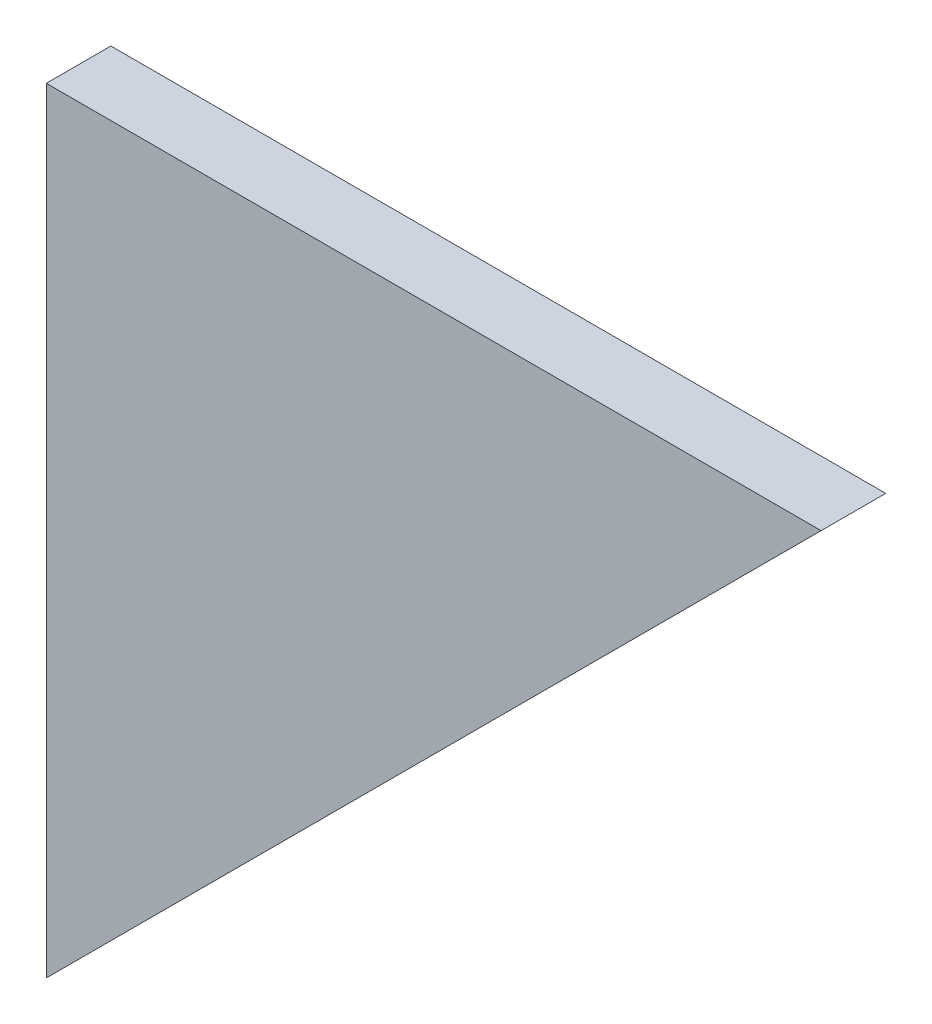
ISO-10303-21;
HEADER;
FILE_DESCRIPTION(('STEP AP214'),'2;1');
FILE_NAME('part.step','',(''),(''),'','','');
FILE_SCHEMA(('AUTOMOTIVE_DESIGN { 1 0 10303 214 1 1 1 1 }'));
ENDSEC;
DATA;
#1=APPLICATION_CONTEXT('core data for automotive mechanical design processes');
#2=APPLICATION_PROTOCOL_DEFINITION('international standard','automotive_design',2000,#1);
#3=PRODUCT_CONTEXT('',#1,'mechanical');
#4=PRODUCT('Part','Part','',(#3));
#5=PRODUCT_RELATED_PRODUCT_CATEGORY('part','',(#4));
#6=PRODUCT_DEFINITION_FORMATION('','',#4);
#7=PRODUCT_DEFINITION_CONTEXT('part definition',#1,'design');
#8=PRODUCT_DEFINITION('design','',#6,#7);
#9=PRODUCT_DEFINITION_SHAPE('','',#8);
#10=(LENGTH_UNIT() NAMED_UNIT(*) SI_UNIT(.MILLI.,.METRE.));
#11=(NAMED_UNIT(*) PLANE_ANGLE_UNIT() SI_UNIT($,.RADIAN.));
#12=(NAMED_UNIT(*) SI_UNIT($,.STERADIAN.) SOLID_ANGLE_UNIT());
#13=UNCERTAINTY_MEASURE_WITH_UNIT(LENGTH_MEASURE(1.E-05),#10,'distance_accuracy_value','');
#14=(GEOMETRIC_REPRESENTATION_CONTEXT(3) GLOBAL_UNCERTAINTY_ASSIGNED_CONTEXT((#13)) GLOBAL_UNIT_ASSIGNED_CONTEXT((#10,
#11,#12)) REPRESENTATION_CONTEXT('',''));
#15=CARTESIAN_POINT('',(0.,0.,0.));
#16=DIRECTION('',(0.,0.,1.));
#17=DIRECTION('',(1.,0.,0.));
#18=AXIS2_PLACEMENT_3D('',#15,#16,#17);
#19=CARTESIAN_POINT('',(0.,-76.2,3.175));
#20=DIRECTION('',(1.,0.,0.));
#21=DIRECTION('',(0.,0.,-1.));
#22=AXIS2_PLACEMENT_3D('',#19,#20,#21);
#23=PLANE('',#22);
#24=DIRECTION('',(0.,-1.,0.));
#25=VECTOR('',#24,1.);
#26=CARTESIAN_POINT('',(0.,-76.2,-3.175));
#27=LINE('',#26,#25);
#28=CARTESIAN_POINT('',(0.,0.,-3.175));
#29=VERTEX_POINT('',#28);
#30=CARTESIAN_POINT('',(0.,-76.2,-3.175));
#31=VERTEX_POINT('',#30);
#32=EDGE_CURVE('E80',#29,#31,#27,.T.);
#33=ORIENTED_EDGE('',*,*,#32,.T.);
#34=DIRECTION('',(0.,0.,-1.));
#35=VECTOR('',#34,1.);
#36=CARTESIAN_POINT('',(0.,-76.2,3.175));
#37=LINE('',#36,#35);
#38=CARTESIAN_POINT('',(0.,-76.2,3.175));
#39=VERTEX_POINT('',#38);
#40=EDGE_CURVE('E11',#39,#31,#37,.T.);
#41=ORIENTED_EDGE('',*,*,#40,.F.);
#42=DIRECTION('',(0.,-1.,0.));
#43=VECTOR('',#42,1.);
#44=CARTESIAN_POINT('',(0.,-76.2,3.175));
#45=LINE('',#44,#43);
#46=CARTESIAN_POINT('',(0.,0.,3.175));
#47=VERTEX_POINT('',#46);
#48=EDGE_CURVE('E73',#47,#39,#45,.T.);
#49=ORIENTED_EDGE('',*,*,#48,.F.);
#50=DIRECTION('',(0.,0.,-1.));
#51=VECTOR('',#50,1.);
#52=CARTESIAN_POINT('',(0.,0.,3.175));
#53=LINE('',#52,#51);
#54=EDGE_CURVE('E81',#47,#29,#53,.T.);
#55=ORIENTED_EDGE('',*,*,#54,.T.);
#56=EDGE_LOOP('',(#33,#41,#49,#55));
#57=FACE_BOUND('',#56,.T.);
#58=ADVANCED_FACE('F33',(#57),#23,.F.);
#59=CARTESIAN_POINT('',(76.2,0.,3.175));
#60=DIRECTION('',(-0.707106781186548,0.707106781186548,0.));
#61=DIRECTION('',(-0.707106781186548,-0.707106781186548,0.));
#62=AXIS2_PLACEMENT_3D('',#59,#60,#61);
#63=PLANE('',#62);
#64=DIRECTION('',(0.707106781186547,0.707106781186547,0.));
#65=VECTOR('',#64,1.);
#66=CARTESIAN_POINT('',(76.2,0.,-3.175));
#67=LINE('',#66,#65);
#68=CARTESIAN_POINT('',(76.2,0.,-3.175));
#69=VERTEX_POINT('',#68);
#70=EDGE_CURVE('E61',#31,#69,#67,.T.);
#71=ORIENTED_EDGE('',*,*,#70,.T.);
#72=DIRECTION('',(0.,0.,-1.));
#73=VECTOR('',#72,1.);
#74=CARTESIAN_POINT('',(76.2,0.,3.175));
#75=LINE('',#74,#73);
#76=CARTESIAN_POINT('',(76.2,0.,3.175));
#77=VERTEX_POINT('',#76);
#78=EDGE_CURVE('E41',#77,#69,#75,.T.);
#79=ORIENTED_EDGE('',*,*,#78,.F.);
#80=DIRECTION('',(0.707106781186547,0.707106781186547,0.));
#81=VECTOR('',#80,1.);
#82=CARTESIAN_POINT('',(76.2,0.,3.175));
#83=LINE('',#82,#81);
#84=EDGE_CURVE('E69',#39,#77,#83,.T.);
#85=ORIENTED_EDGE('',*,*,#84,.F.);
#86=ORIENTED_EDGE('',*,*,#40,.T.);
#87=EDGE_LOOP('',(#71,#79,#85,#86));
#88=FACE_BOUND('',#87,.T.);
#89=ADVANCED_FACE('F70',(#88),#63,.F.);
#90=CARTESIAN_POINT('',(0.,0.,3.175));
#91=DIRECTION('',(0.,-1.,0.));
#92=DIRECTION('',(0.,0.,-1.));
#93=AXIS2_PLACEMENT_3D('',#90,#91,#92);
#94=PLANE('',#93);
#95=DIRECTION('',(-1.,0.,0.));
#96=VECTOR('',#95,1.);
#97=CARTESIAN_POINT('',(0.,0.,-3.175));
#98=LINE('',#97,#96);
#99=EDGE_CURVE('E66',#69,#29,#98,.T.);
#100=ORIENTED_EDGE('',*,*,#99,.T.);
#101=ORIENTED_EDGE('',*,*,#54,.F.);
#102=DIRECTION('',(-1.,0.,0.));
#103=VECTOR('',#102,1.);
#104=CARTESIAN_POINT('',(0.,0.,3.175));
#105=LINE('',#104,#103);
#106=EDGE_CURVE('E49',#77,#47,#105,.T.);
#107=ORIENTED_EDGE('',*,*,#106,.F.);
#108=ORIENTED_EDGE('',*,*,#78,.T.);
#109=EDGE_LOOP('',(#100,#101,#107,#108));
#110=FACE_BOUND('',#109,.T.);
#111=ADVANCED_FACE('F88',(#110),#94,.F.);
#112=CARTESIAN_POINT('',(0.,0.,3.175));
#113=DIRECTION('',(0.,0.,-1.));
#114=DIRECTION('',(-1.,0.,0.));
#115=AXIS2_PLACEMENT_3D('',#112,#113,#114);
#116=PLANE('',#115);
#117=ORIENTED_EDGE('',*,*,#48,.T.);
#118=ORIENTED_EDGE('',*,*,#84,.T.);
#119=ORIENTED_EDGE('',*,*,#106,.T.);
#120=EDGE_LOOP('',(#117,#118,#119));
#121=FACE_BOUND('',#120,.T.);
#122=ADVANCED_FACE('F76',(#121),#116,.F.);
#123=CARTESIAN_POINT('',(0.,0.,-3.175));
#124=DIRECTION('',(0.,0.,-1.));
#125=DIRECTION('',(-1.,0.,0.));
#126=AXIS2_PLACEMENT_3D('',#123,#124,#125);
#127=PLANE('',#126);
#128=ORIENTED_EDGE('',*,*,#32,.F.);
#129=ORIENTED_EDGE('',*,*,#99,.F.);
#130=ORIENTED_EDGE('',*,*,#70,.F.);
#131=EDGE_LOOP('',(#128,#129,#130));
#132=FACE_BOUND('',#131,.T.);
#133=ADVANCED_FACE('F89',(#132),#127,.T.);
#134=CLOSED_SHELL('',(#58,#89,#111,#122,#133));
#135=MANIFOLD_SOLID_BREP('B2',#134);
#136=ADVANCED_BREP_SHAPE_REPRESENTATION('',(#18,#135),#14);
#137=SHAPE_DEFINITION_REPRESENTATION(#9,#136);
ENDSEC;
END-ISO-10303-21;
